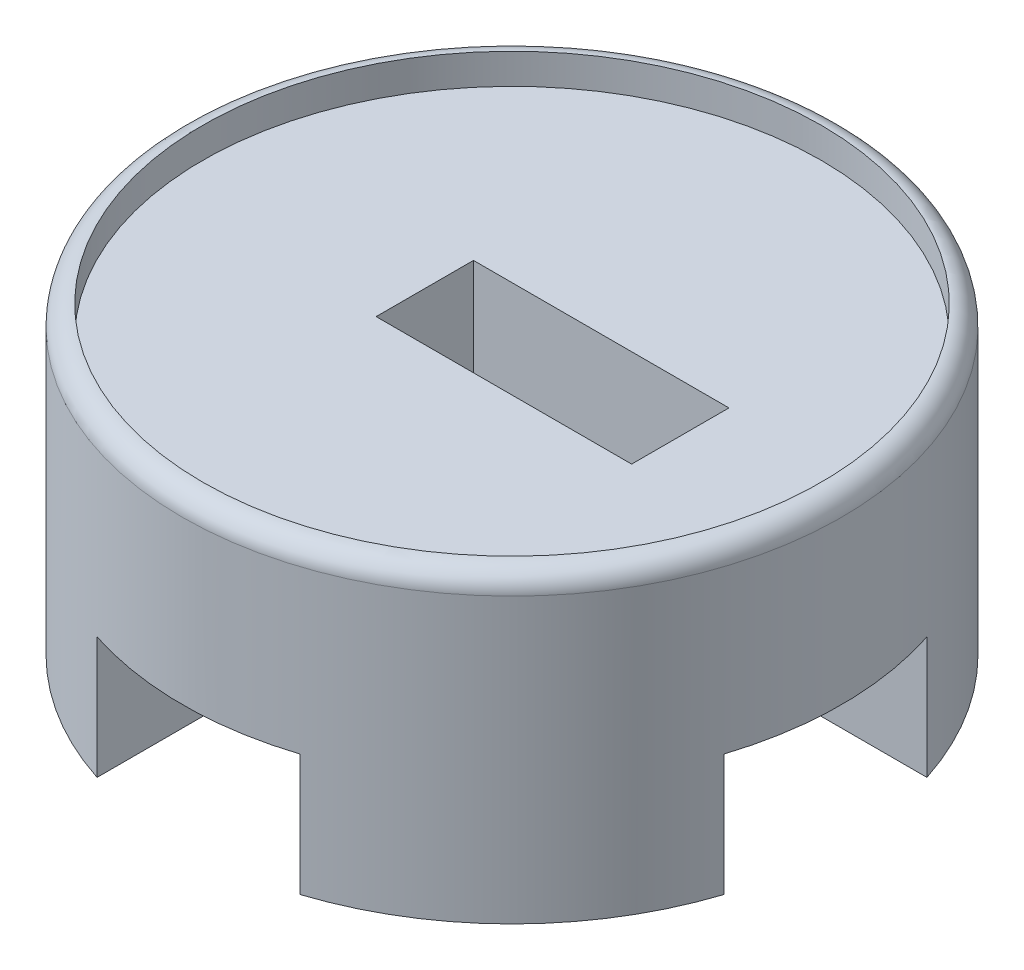
ISO-10303-21;
HEADER;
FILE_DESCRIPTION(('STEP AP214'),'2;1');
FILE_NAME('part.step','',(''),(''),'','','');
FILE_SCHEMA(('AUTOMOTIVE_DESIGN { 1 0 10303 214 1 1 1 1 }'));
ENDSEC;
DATA;
#1=APPLICATION_CONTEXT('core data for automotive mechanical design processes');
#2=APPLICATION_PROTOCOL_DEFINITION('international standard','automotive_design',2000,#1);
#3=PRODUCT_CONTEXT('',#1,'mechanical');
#4=PRODUCT('Part','Part','',(#3));
#5=PRODUCT_RELATED_PRODUCT_CATEGORY('part','',(#4));
#6=PRODUCT_DEFINITION_FORMATION('','',#4);
#7=PRODUCT_DEFINITION_CONTEXT('part definition',#1,'design');
#8=PRODUCT_DEFINITION('design','',#6,#7);
#9=PRODUCT_DEFINITION_SHAPE('','',#8);
#10=(LENGTH_UNIT() NAMED_UNIT(*) SI_UNIT(.MILLI.,.METRE.));
#11=(NAMED_UNIT(*) PLANE_ANGLE_UNIT() SI_UNIT($,.RADIAN.));
#12=(NAMED_UNIT(*) SI_UNIT($,.STERADIAN.) SOLID_ANGLE_UNIT());
#13=UNCERTAINTY_MEASURE_WITH_UNIT(LENGTH_MEASURE(1.E-05),#10,'distance_accuracy_value','');
#14=(GEOMETRIC_REPRESENTATION_CONTEXT(3) GLOBAL_UNCERTAINTY_ASSIGNED_CONTEXT((#13)) GLOBAL_UNIT_ASSIGNED_CONTEXT((#10,
#11,#12)) REPRESENTATION_CONTEXT('',''));
#15=CARTESIAN_POINT('',(0.,0.,0.));
#16=DIRECTION('',(0.,0.,1.));
#17=DIRECTION('',(1.,0.,0.));
#18=AXIS2_PLACEMENT_3D('',#15,#16,#17);
#19=CARTESIAN_POINT('',(0.,20.32,0.));
#20=DIRECTION('',(0.,-1.,0.));
#21=DIRECTION('',(0.,0.,-1.));
#22=AXIS2_PLACEMENT_3D('',#19,#20,#21);
#23=PLANE('',#22);
#24=DIRECTION('',(0.,0.,-1.));
#25=VECTOR('',#24,1.);
#26=CARTESIAN_POINT('',(16.383,20.32,0.));
#27=LINE('',#26,#25);
#28=CARTESIAN_POINT('',(16.383,20.32,6.096));
#29=VERTEX_POINT('',#28);
#30=CARTESIAN_POINT('',(16.383,20.32,-6.096));
#31=VERTEX_POINT('',#30);
#32=EDGE_CURVE('E203',#29,#31,#27,.T.);
#33=ORIENTED_EDGE('',*,*,#32,.F.);
#34=DIRECTION('',(1.,0.,0.));
#35=VECTOR('',#34,1.);
#36=CARTESIAN_POINT('',(-10.922,20.32,6.096));
#37=LINE('',#36,#35);
#38=CARTESIAN_POINT('',(21.082,20.32,6.096));
#39=VERTEX_POINT('',#38);
#40=EDGE_CURVE('E215',#29,#39,#37,.T.);
#41=ORIENTED_EDGE('',*,*,#40,.T.);
#42=DIRECTION('',(0.,0.,-1.));
#43=VECTOR('',#42,1.);
#44=CARTESIAN_POINT('',(21.082,20.32,6.096));
#45=LINE('',#44,#43);
#46=CARTESIAN_POINT('',(21.082,20.32,-6.096));
#47=VERTEX_POINT('',#46);
#48=EDGE_CURVE('E228',#39,#47,#45,.T.);
#49=ORIENTED_EDGE('',*,*,#48,.T.);
#50=DIRECTION('',(-1.,0.,0.));
#51=VECTOR('',#50,1.);
#52=CARTESIAN_POINT('',(-10.922,20.32,-6.096));
#53=LINE('',#52,#51);
#54=EDGE_CURVE('E218',#47,#31,#53,.T.);
#55=ORIENTED_EDGE('',*,*,#54,.T.);
#56=EDGE_LOOP('',(#33,#41,#49,#55));
#57=FACE_BOUND('',#56,.T.);
#58=ADVANCED_FACE('F39',(#57),#23,.F.);
#59=CARTESIAN_POINT('',(0.,38.1,0.));
#60=DIRECTION('',(0.,-1.,0.));
#61=DIRECTION('',(0.,0.,-1.));
#62=AXIS2_PLACEMENT_3D('',#59,#60,#61);
#63=CYLINDRICAL_SURFACE('',#62,41.275);
#64=CARTESIAN_POINT('',(0.,35.56,0.));
#65=DIRECTION('',(0.,1.,0.));
#66=DIRECTION('',(0.,0.,1.));
#67=AXIS2_PLACEMENT_3D('',#64,#65,#66);
#68=CIRCLE('',#67,41.275);
#69=CARTESIAN_POINT('',(0.,35.56,41.275));
#70=VERTEX_POINT('',#69);
#71=EDGE_CURVE('E351',#70,#70,#68,.F.);
#72=ORIENTED_EDGE('',*,*,#71,.T.);
#73=EDGE_LOOP('',(#72));
#74=FACE_BOUND('',#73,.T.);
#75=CARTESIAN_POINT('',(0.,15.24,0.));
#76=DIRECTION('',(0.,1.,0.));
#77=DIRECTION('',(0.,0.,1.));
#78=AXIS2_PLACEMENT_3D('',#75,#76,#77);
#79=CIRCLE('',#78,41.275);
#80=CARTESIAN_POINT('',(39.2725810840082,15.24,-12.7));
#81=VERTEX_POINT('',#80);
#82=CARTESIAN_POINT('',(39.2725810840082,15.24,12.7));
#83=VERTEX_POINT('',#82);
#84=EDGE_CURVE('E309',#81,#83,#79,.F.);
#85=ORIENTED_EDGE('',*,*,#84,.F.);
#86=DIRECTION('',(0.,-1.,0.));
#87=VECTOR('',#86,1.);
#88=CARTESIAN_POINT('',(39.2725810840082,151.033329573899,-12.7));
#89=LINE('',#88,#87);
#90=CARTESIAN_POINT('',(39.2725810840082,0.,-12.7));
#91=VERTEX_POINT('',#90);
#92=EDGE_CURVE('E283',#81,#91,#89,.T.);
#93=ORIENTED_EDGE('',*,*,#92,.T.);
#94=CARTESIAN_POINT('',(0.,0.,0.));
#95=DIRECTION('',(0.,1.,0.));
#96=DIRECTION('',(0.,0.,1.));
#97=AXIS2_PLACEMENT_3D('',#94,#95,#96);
#98=CIRCLE('',#97,41.275);
#99=CARTESIAN_POINT('',(12.7,0.,-39.2725810840082));
#100=VERTEX_POINT('',#99);
#101=EDGE_CURVE('E335',#91,#100,#98,.T.);
#102=ORIENTED_EDGE('',*,*,#101,.T.);
#103=DIRECTION('',(0.,-1.,0.));
#104=VECTOR('',#103,1.);
#105=CARTESIAN_POINT('',(12.7,151.033329573899,-39.2725810840082));
#106=LINE('',#105,#104);
#107=CARTESIAN_POINT('',(12.7,15.24,-39.2725810840082));
#108=VERTEX_POINT('',#107);
#109=EDGE_CURVE('E288',#108,#100,#106,.T.);
#110=ORIENTED_EDGE('',*,*,#109,.F.);
#111=CARTESIAN_POINT('',(0.,15.24,0.));
#112=DIRECTION('',(0.,1.,0.));
#113=DIRECTION('',(0.,0.,1.));
#114=AXIS2_PLACEMENT_3D('',#111,#112,#113);
#115=CIRCLE('',#114,41.275);
#116=CARTESIAN_POINT('',(-12.7,15.24,-39.2725810840082));
#117=VERTEX_POINT('',#116);
#118=EDGE_CURVE('E257',#117,#108,#115,.F.);
#119=ORIENTED_EDGE('',*,*,#118,.F.);
#120=DIRECTION('',(0.,-1.,0.));
#121=VECTOR('',#120,1.);
#122=CARTESIAN_POINT('',(-12.7,151.033329573899,-39.2725810840082));
#123=LINE('',#122,#121);
#124=CARTESIAN_POINT('',(-12.7,0.,-39.2725810840082));
#125=VERTEX_POINT('',#124);
#126=EDGE_CURVE('E258',#117,#125,#123,.T.);
#127=ORIENTED_EDGE('',*,*,#126,.T.);
#128=CARTESIAN_POINT('',(-39.2725810840082,0.,-12.7));
#129=VERTEX_POINT('',#128);
#130=EDGE_CURVE('E400',#125,#129,#98,.T.);
#131=ORIENTED_EDGE('',*,*,#130,.T.);
#132=DIRECTION('',(0.,-1.,0.));
#133=VECTOR('',#132,1.);
#134=CARTESIAN_POINT('',(-39.2725810840082,151.033329573899,-12.7));
#135=LINE('',#134,#133);
#136=CARTESIAN_POINT('',(-39.2725810840082,15.24,-12.7));
#137=VERTEX_POINT('',#136);
#138=EDGE_CURVE('E296',#137,#129,#135,.T.);
#139=ORIENTED_EDGE('',*,*,#138,.F.);
#140=CARTESIAN_POINT('',(0.,15.24,0.));
#141=DIRECTION('',(0.,1.,0.));
#142=DIRECTION('',(0.,0.,1.));
#143=AXIS2_PLACEMENT_3D('',#140,#141,#142);
#144=CIRCLE('',#143,41.275);
#145=CARTESIAN_POINT('',(-39.2725810840082,15.24,12.7));
#146=VERTEX_POINT('',#145);
#147=EDGE_CURVE('E266',#146,#137,#144,.F.);
#148=ORIENTED_EDGE('',*,*,#147,.F.);
#149=DIRECTION('',(0.,-1.,0.));
#150=VECTOR('',#149,1.);
#151=CARTESIAN_POINT('',(-39.2725810840082,151.033329573899,12.7));
#152=LINE('',#151,#150);
#153=CARTESIAN_POINT('',(-39.2725810840082,0.,12.7));
#154=VERTEX_POINT('',#153);
#155=EDGE_CURVE('E267',#146,#154,#152,.T.);
#156=ORIENTED_EDGE('',*,*,#155,.T.);
#157=CARTESIAN_POINT('',(-12.7,0.,39.2725810840082));
#158=VERTEX_POINT('',#157);
#159=EDGE_CURVE('E329',#154,#158,#98,.T.);
#160=ORIENTED_EDGE('',*,*,#159,.T.);
#161=DIRECTION('',(0.,-1.,0.));
#162=VECTOR('',#161,1.);
#163=CARTESIAN_POINT('',(-12.7,151.033329573899,39.2725810840082));
#164=LINE('',#163,#162);
#165=CARTESIAN_POINT('',(-12.7,15.24,39.2725810840082));
#166=VERTEX_POINT('',#165);
#167=EDGE_CURVE('E270',#166,#158,#164,.T.);
#168=ORIENTED_EDGE('',*,*,#167,.F.);
#169=CARTESIAN_POINT('',(0.,15.24,0.));
#170=DIRECTION('',(0.,1.,0.));
#171=DIRECTION('',(0.,0.,1.));
#172=AXIS2_PLACEMENT_3D('',#169,#170,#171);
#173=CIRCLE('',#172,41.275);
#174=CARTESIAN_POINT('',(12.7,15.24,39.2725810840082));
#175=VERTEX_POINT('',#174);
#176=EDGE_CURVE('E303',#175,#166,#173,.F.);
#177=ORIENTED_EDGE('',*,*,#176,.F.);
#178=DIRECTION('',(0.,-1.,0.));
#179=VECTOR('',#178,1.);
#180=CARTESIAN_POINT('',(12.7,151.033329573899,39.2725810840082));
#181=LINE('',#180,#179);
#182=CARTESIAN_POINT('',(12.7,0.,39.2725810840082));
#183=VERTEX_POINT('',#182);
#184=EDGE_CURVE('E306',#175,#183,#181,.T.);
#185=ORIENTED_EDGE('',*,*,#184,.T.);
#186=CARTESIAN_POINT('',(39.2725810840082,0.,12.7));
#187=VERTEX_POINT('',#186);
#188=EDGE_CURVE('E332',#183,#187,#98,.T.);
#189=ORIENTED_EDGE('',*,*,#188,.T.);
#190=DIRECTION('',(0.,-1.,0.));
#191=VECTOR('',#190,1.);
#192=CARTESIAN_POINT('',(39.2725810840082,151.033329573899,12.7));
#193=LINE('',#192,#191);
#194=EDGE_CURVE('E276',#83,#187,#193,.T.);
#195=ORIENTED_EDGE('',*,*,#194,.F.);
#196=EDGE_LOOP('',(#85,#93,#102,#110,#119,#127,#131,#139,#148,#156,#160,#168,#177,#185,#189,#195));
#197=FACE_BOUND('',#196,.T.);
#198=ADVANCED_FACE('F399',(#74,#197),#63,.T.);
#199=CARTESIAN_POINT('',(0.,0.,0.));
#200=DIRECTION('',(0.,1.,0.));
#201=DIRECTION('',(0.,0.,1.));
#202=AXIS2_PLACEMENT_3D('',#199,#200,#201);
#203=PLANE('',#202);
#204=DIRECTION('',(0.,0.,1.));
#205=VECTOR('',#204,1.);
#206=CARTESIAN_POINT('',(12.7,0.,0.));
#207=LINE('',#206,#205);
#208=CARTESIAN_POINT('',(12.7,0.,15.24));
#209=VERTEX_POINT('',#208);
#210=EDGE_CURVE('E262',#209,#183,#207,.T.);
#211=ORIENTED_EDGE('',*,*,#210,.F.);
#212=CARTESIAN_POINT('',(15.24,0.,15.24));
#213=DIRECTION('',(0.,1.,0.));
#214=DIRECTION('',(0.,0.,1.));
#215=AXIS2_PLACEMENT_3D('',#212,#213,#214);
#216=CIRCLE('',#215,2.54);
#217=CARTESIAN_POINT('',(15.24,0.,12.7));
#218=VERTEX_POINT('',#217);
#219=EDGE_CURVE('E357',#209,#218,#216,.F.);
#220=ORIENTED_EDGE('',*,*,#219,.T.);
#221=DIRECTION('',(1.,0.,0.));
#222=VECTOR('',#221,1.);
#223=CARTESIAN_POINT('',(0.,0.,12.7));
#224=LINE('',#223,#222);
#225=EDGE_CURVE('E273',#218,#187,#224,.T.);
#226=ORIENTED_EDGE('',*,*,#225,.T.);
#227=ORIENTED_EDGE('',*,*,#188,.F.);
#228=EDGE_LOOP('',(#211,#220,#226,#227));
#229=FACE_BOUND('',#228,.T.);
#230=ADVANCED_FACE('F438',(#229),#203,.F.);
#231=DIRECTION('',(1.,0.,0.));
#232=VECTOR('',#231,1.);
#233=CARTESIAN_POINT('',(0.,0.,12.7));
#234=LINE('',#233,#232);
#235=CARTESIAN_POINT('',(-15.24,0.,12.7));
#236=VERTEX_POINT('',#235);
#237=EDGE_CURVE('E263',#154,#236,#234,.T.);
#238=ORIENTED_EDGE('',*,*,#237,.T.);
#239=CARTESIAN_POINT('',(-15.24,0.,15.24));
#240=DIRECTION('',(0.,1.,0.));
#241=DIRECTION('',(0.,0.,1.));
#242=AXIS2_PLACEMENT_3D('',#239,#240,#241);
#243=CIRCLE('',#242,2.54);
#244=CARTESIAN_POINT('',(-12.7,0.,15.24));
#245=VERTEX_POINT('',#244);
#246=EDGE_CURVE('E364',#236,#245,#243,.F.);
#247=ORIENTED_EDGE('',*,*,#246,.T.);
#248=DIRECTION('',(0.,0.,1.));
#249=VECTOR('',#248,1.);
#250=CARTESIAN_POINT('',(-12.7,0.,0.));
#251=LINE('',#250,#249);
#252=EDGE_CURVE('E268',#245,#158,#251,.T.);
#253=ORIENTED_EDGE('',*,*,#252,.T.);
#254=ORIENTED_EDGE('',*,*,#159,.F.);
#255=EDGE_LOOP('',(#238,#247,#253,#254));
#256=FACE_BOUND('',#255,.T.);
#257=ADVANCED_FACE('F390',(#256),#203,.F.);
#258=DIRECTION('',(0.,0.,1.));
#259=VECTOR('',#258,1.);
#260=CARTESIAN_POINT('',(-12.7,0.,0.));
#261=LINE('',#260,#259);
#262=CARTESIAN_POINT('',(-12.7,0.,-15.24));
#263=VERTEX_POINT('',#262);
#264=EDGE_CURVE('E255',#125,#263,#261,.T.);
#265=ORIENTED_EDGE('',*,*,#264,.T.);
#266=CARTESIAN_POINT('',(-15.24,0.,-15.24));
#267=DIRECTION('',(0.,1.,0.));
#268=DIRECTION('',(0.,0.,1.));
#269=AXIS2_PLACEMENT_3D('',#266,#267,#268);
#270=CIRCLE('',#269,2.54);
#271=CARTESIAN_POINT('',(-15.24,0.,-12.7));
#272=VERTEX_POINT('',#271);
#273=EDGE_CURVE('E62',#263,#272,#270,.F.);
#274=ORIENTED_EDGE('',*,*,#273,.T.);
#275=DIRECTION('',(1.,0.,0.));
#276=VECTOR('',#275,1.);
#277=CARTESIAN_POINT('',(0.,0.,-12.7));
#278=LINE('',#277,#276);
#279=EDGE_CURVE('E259',#129,#272,#278,.T.);
#280=ORIENTED_EDGE('',*,*,#279,.F.);
#281=ORIENTED_EDGE('',*,*,#130,.F.);
#282=EDGE_LOOP('',(#265,#274,#280,#281));
#283=FACE_BOUND('',#282,.T.);
#284=ADVANCED_FACE('F501',(#283),#203,.F.);
#285=DIRECTION('',(1.,0.,0.));
#286=VECTOR('',#285,1.);
#287=CARTESIAN_POINT('',(0.,0.,-12.7));
#288=LINE('',#287,#286);
#289=CARTESIAN_POINT('',(15.24,0.,-12.7));
#290=VERTEX_POINT('',#289);
#291=EDGE_CURVE('E272',#290,#91,#288,.T.);
#292=ORIENTED_EDGE('',*,*,#291,.F.);
#293=CARTESIAN_POINT('',(15.24,0.,-15.24));
#294=DIRECTION('',(0.,1.,0.));
#295=DIRECTION('',(0.,0.,1.));
#296=AXIS2_PLACEMENT_3D('',#293,#294,#295);
#297=CIRCLE('',#296,2.54);
#298=CARTESIAN_POINT('',(12.7,0.,-15.24));
#299=VERTEX_POINT('',#298);
#300=EDGE_CURVE('E347',#290,#299,#297,.F.);
#301=ORIENTED_EDGE('',*,*,#300,.T.);
#302=DIRECTION('',(0.,0.,1.));
#303=VECTOR('',#302,1.);
#304=CARTESIAN_POINT('',(12.7,0.,0.));
#305=LINE('',#304,#303);
#306=EDGE_CURVE('E278',#100,#299,#305,.T.);
#307=ORIENTED_EDGE('',*,*,#306,.F.);
#308=ORIENTED_EDGE('',*,*,#101,.F.);
#309=EDGE_LOOP('',(#292,#301,#307,#308));
#310=FACE_BOUND('',#309,.T.);
#311=ADVANCED_FACE('F412',(#310),#203,.F.);
#312=CARTESIAN_POINT('',(0.,34.29,0.));
#313=DIRECTION('',(0.,1.,0.));
#314=DIRECTION('',(0.,0.,1.));
#315=AXIS2_PLACEMENT_3D('',#312,#313,#314);
#316=CYLINDRICAL_SURFACE('',#315,38.735);
#317=CARTESIAN_POINT('',(0.,34.29,0.));
#318=DIRECTION('',(0.,1.,0.));
#319=DIRECTION('',(0.,0.,1.));
#320=AXIS2_PLACEMENT_3D('',#317,#318,#319);
#321=CIRCLE('',#320,38.735);
#322=CARTESIAN_POINT('',(0.,34.29,38.735));
#323=VERTEX_POINT('',#322);
#324=EDGE_CURVE('E326',#323,#323,#321,.T.);
#325=CARTESIAN_POINT('',(0.,38.1,0.));
#326=DIRECTION('',(0.,1.,0.));
#327=DIRECTION('',(0.,0.,1.));
#328=AXIS2_PLACEMENT_3D('',#325,#326,#327);
#329=CIRCLE('',#328,38.735);
#330=CARTESIAN_POINT('',(0.,38.1,38.735));
#331=VERTEX_POINT('',#330);
#332=EDGE_CURVE('E287',#331,#331,#329,.T.);
#333=CARTESIAN_POINT('',(0.,34.29,38.735));
#334=CARTESIAN_POINT('',(0.,34.3296875,38.735));
#335=CARTESIAN_POINT('',(0.,34.369375,38.735));
#336=CARTESIAN_POINT('',(0.,34.44875,38.735));
#337=CARTESIAN_POINT('',(0.,34.4884375,38.735));
#338=CARTESIAN_POINT('',(0.,34.5678125,38.735));
#339=CARTESIAN_POINT('',(0.,34.6075,38.735));
#340=CARTESIAN_POINT('',(0.,34.686875,38.735));
#341=CARTESIAN_POINT('',(0.,34.7265625,38.735));
#342=CARTESIAN_POINT('',(0.,34.8059375,38.735));
#343=CARTESIAN_POINT('',(0.,34.845625,38.735));
#344=CARTESIAN_POINT('',(0.,34.925,38.735));
#345=CARTESIAN_POINT('',(0.,34.9646875,38.735));
#346=CARTESIAN_POINT('',(0.,35.0440625,38.735));
#347=CARTESIAN_POINT('',(0.,35.08375,38.735));
#348=CARTESIAN_POINT('',(0.,35.163125,38.735));
#349=CARTESIAN_POINT('',(0.,35.2028125,38.735));
#350=CARTESIAN_POINT('',(0.,35.2821875,38.735));
#351=CARTESIAN_POINT('',(0.,35.321875,38.735));
#352=CARTESIAN_POINT('',(0.,35.40125,38.735));
#353=CARTESIAN_POINT('',(0.,35.4409375,38.735));
#354=CARTESIAN_POINT('',(0.,35.5203125,38.735));
#355=CARTESIAN_POINT('',(0.,35.56,38.735));
#356=CARTESIAN_POINT('',(0.,35.639375,38.735));
#357=CARTESIAN_POINT('',(0.,35.6790625,38.735));
#358=CARTESIAN_POINT('',(0.,35.7584375,38.735));
#359=CARTESIAN_POINT('',(0.,35.798125,38.735));
#360=CARTESIAN_POINT('',(0.,35.8775,38.735));
#361=CARTESIAN_POINT('',(0.,35.9171875,38.735));
#362=CARTESIAN_POINT('',(0.,35.9965625,38.735));
#363=CARTESIAN_POINT('',(0.,36.03625,38.735));
#364=CARTESIAN_POINT('',(0.,36.115625,38.735));
#365=CARTESIAN_POINT('',(0.,36.1553125,38.735));
#366=CARTESIAN_POINT('',(0.,36.2346875,38.735));
#367=CARTESIAN_POINT('',(0.,36.274375,38.735));
#368=CARTESIAN_POINT('',(0.,36.35375,38.735));
#369=CARTESIAN_POINT('',(0.,36.3934375,38.735));
#370=CARTESIAN_POINT('',(0.,36.4728125,38.735));
#371=CARTESIAN_POINT('',(0.,36.5125,38.735));
#372=CARTESIAN_POINT('',(0.,36.591875,38.735));
#373=CARTESIAN_POINT('',(0.,36.6315625,38.735));
#374=CARTESIAN_POINT('',(0.,36.7109375,38.735));
#375=CARTESIAN_POINT('',(0.,36.750625,38.735));
#376=CARTESIAN_POINT('',(0.,36.83,38.735));
#377=CARTESIAN_POINT('',(0.,36.8696875,38.735));
#378=CARTESIAN_POINT('',(0.,36.9490625,38.735));
#379=CARTESIAN_POINT('',(0.,36.98875,38.735));
#380=CARTESIAN_POINT('',(0.,37.068125,38.735));
#381=CARTESIAN_POINT('',(0.,37.1078125,38.735));
#382=CARTESIAN_POINT('',(0.,37.1871875,38.735));
#383=CARTESIAN_POINT('',(0.,37.226875,38.735));
#384=CARTESIAN_POINT('',(0.,37.30625,38.735));
#385=CARTESIAN_POINT('',(0.,37.3459375,38.735));
#386=CARTESIAN_POINT('',(0.,37.4253125,38.735));
#387=CARTESIAN_POINT('',(0.,37.465,38.735));
#388=CARTESIAN_POINT('',(0.,37.544375,38.735));
#389=CARTESIAN_POINT('',(0.,37.5840625,38.735));
#390=CARTESIAN_POINT('',(0.,37.6634375,38.735));
#391=CARTESIAN_POINT('',(0.,37.703125,38.735));
#392=CARTESIAN_POINT('',(0.,37.7825,38.735));
#393=CARTESIAN_POINT('',(0.,37.8221875,38.735));
#394=CARTESIAN_POINT('',(0.,37.9015625,38.735));
#395=CARTESIAN_POINT('',(0.,37.94125,38.735));
#396=CARTESIAN_POINT('',(0.,38.020625,38.735));
#397=CARTESIAN_POINT('',(0.,38.0603125,38.735));
#398=CARTESIAN_POINT('',(0.,38.1,38.735));
#399=B_SPLINE_CURVE_WITH_KNOTS('',3,(#333,#334,#335,#336,#337,#338,#339,#340,#341,#342,#343,
#344,#345,#346,#347,#348,#349,#350,#351,#352,#353,#354,#355,#356,#357,#358,#359,#360,#361,#362,
#363,#364,#365,#366,#367,#368,#369,#370,#371,#372,#373,#374,#375,#376,#377,#378,#379,#380,#381,
#382,#383,#384,#385,#386,#387,#388,#389,#390,#391,#392,#393,#394,#395,#396,#397,#398),
.UNSPECIFIED.,.F.,.F.,(4,2,2,2,2,2,2,2,2,2,2,2,2,2,2,2,2,2,2,2,2,2,2,2,2,2,2,2,2,2,2,2,4),(0.,
0.119062499999996,0.238124999999999,0.357187499999995,0.476249999999998,0.595312499999993,
0.714374999999996,0.833437499999999,0.952499999999995,1.0715625,1.19062499999999,1.3096875,
1.42875,1.5478125,1.666875,1.78593749999999,1.905,2.0240625,2.143125,2.2621875,2.38124999999999,
2.5003125,2.619375,2.7384375,2.8575,2.97656249999999,3.095625,3.2146875,3.33375,3.4528125,
3.571875,3.6909375,3.81),.UNSPECIFIED.);
#400=EDGE_CURVE('BSEAM493',#323,#331,#399,.T.);
#401=ORIENTED_EDGE('',*,*,#324,.F.);
#402=ORIENTED_EDGE('',*,*,#332,.T.);
#403=ORIENTED_EDGE('',*,*,#400,.T.);
#404=ORIENTED_EDGE('',*,*,#400,.F.);
#405=EDGE_LOOP('',(#401,#403,#402,#404));
#406=FACE_BOUND('',#405,.T.);
#407=ADVANCED_FACE('F493',(#406),#316,.F.);
#408=CARTESIAN_POINT('',(0.,34.29,0.));
#409=DIRECTION('',(0.,1.,0.));
#410=DIRECTION('',(0.,0.,1.));
#411=AXIS2_PLACEMENT_3D('',#408,#409,#410);
#412=PLANE('',#411);
#413=DIRECTION('',(0.,0.,1.));
#414=VECTOR('',#413,1.);
#415=CARTESIAN_POINT('',(-10.922,34.29,6.096));
#416=LINE('',#415,#414);
#417=CARTESIAN_POINT('',(-10.922,34.29,-6.096));
#418=VERTEX_POINT('',#417);
#419=CARTESIAN_POINT('',(-10.922,34.29,6.096));
#420=VERTEX_POINT('',#419);
#421=EDGE_CURVE('E237',#418,#420,#416,.T.);
#422=ORIENTED_EDGE('',*,*,#421,.F.);
#423=DIRECTION('',(-1.,0.,0.));
#424=VECTOR('',#423,1.);
#425=CARTESIAN_POINT('',(-10.922,34.29,-6.096));
#426=LINE('',#425,#424);
#427=CARTESIAN_POINT('',(21.082,34.29,-6.096));
#428=VERTEX_POINT('',#427);
#429=EDGE_CURVE('E230',#428,#418,#426,.T.);
#430=ORIENTED_EDGE('',*,*,#429,.F.);
#431=DIRECTION('',(0.,0.,-1.));
#432=VECTOR('',#431,1.);
#433=CARTESIAN_POINT('',(21.082,34.29,6.096));
#434=LINE('',#433,#432);
#435=CARTESIAN_POINT('',(21.082,34.29,6.096));
#436=VERTEX_POINT('',#435);
#437=EDGE_CURVE('E243',#436,#428,#434,.T.);
#438=ORIENTED_EDGE('',*,*,#437,.F.);
#439=DIRECTION('',(1.,0.,0.));
#440=VECTOR('',#439,1.);
#441=CARTESIAN_POINT('',(-10.922,34.29,6.096));
#442=LINE('',#441,#440);
#443=EDGE_CURVE('E240',#420,#436,#442,.T.);
#444=ORIENTED_EDGE('',*,*,#443,.F.);
#445=EDGE_LOOP('',(#422,#430,#438,#444));
#446=FACE_BOUND('',#445,.T.);
#447=ORIENTED_EDGE('',*,*,#324,.T.);
#448=EDGE_LOOP('',(#447));
#449=FACE_BOUND('',#448,.T.);
#450=ADVANCED_FACE('F488',(#446,#449),#412,.T.);
#451=CARTESIAN_POINT('',(0.,15.24,0.));
#452=DIRECTION('',(0.,1.,0.));
#453=DIRECTION('',(0.,0.,1.));
#454=AXIS2_PLACEMENT_3D('',#451,#452,#453);
#455=PLANE('',#454);
#456=DIRECTION('',(0.,0.,-1.));
#457=VECTOR('',#456,1.);
#458=CARTESIAN_POINT('',(-6.223,15.24,0.));
#459=LINE('',#458,#457);
#460=CARTESIAN_POINT('',(-6.223,15.24,6.096));
#461=VERTEX_POINT('',#460);
#462=CARTESIAN_POINT('',(-6.223,15.24,-6.096));
#463=VERTEX_POINT('',#462);
#464=EDGE_CURVE('E340',#461,#463,#459,.T.);
#465=ORIENTED_EDGE('',*,*,#464,.F.);
#466=DIRECTION('',(1.,0.,0.));
#467=VECTOR('',#466,1.);
#468=CARTESIAN_POINT('',(0.,15.24,6.096));
#469=LINE('',#468,#467);
#470=CARTESIAN_POINT('',(16.383,15.24,6.096));
#471=VERTEX_POINT('',#470);
#472=EDGE_CURVE('E342',#461,#471,#469,.T.);
#473=ORIENTED_EDGE('',*,*,#472,.T.);
#474=DIRECTION('',(0.,0.,-1.));
#475=VECTOR('',#474,1.);
#476=CARTESIAN_POINT('',(16.383,15.24,0.));
#477=LINE('',#476,#475);
#478=CARTESIAN_POINT('',(16.383,15.24,-6.096));
#479=VERTEX_POINT('',#478);
#480=EDGE_CURVE('E206',#471,#479,#477,.T.);
#481=ORIENTED_EDGE('',*,*,#480,.T.);
#482=DIRECTION('',(-1.,0.,0.));
#483=VECTOR('',#482,1.);
#484=CARTESIAN_POINT('',(0.,15.24,-6.096));
#485=LINE('',#484,#483);
#486=EDGE_CURVE('E337',#479,#463,#485,.T.);
#487=ORIENTED_EDGE('',*,*,#486,.T.);
#488=EDGE_LOOP('',(#465,#473,#481,#487));
#489=FACE_BOUND('',#488,.T.);
#490=DIRECTION('',(0.,0.,1.));
#491=VECTOR('',#490,1.);
#492=CARTESIAN_POINT('',(12.7,15.24,0.));
#493=LINE('',#492,#491);
#494=CARTESIAN_POINT('',(12.7,15.24,-15.24));
#495=VERTEX_POINT('',#494);
#496=EDGE_CURVE('E284',#108,#495,#493,.T.);
#497=ORIENTED_EDGE('',*,*,#496,.T.);
#498=CARTESIAN_POINT('',(15.24,15.24,-15.24));
#499=DIRECTION('',(0.,1.,0.));
#500=DIRECTION('',(0.,0.,1.));
#501=AXIS2_PLACEMENT_3D('',#498,#499,#500);
#502=CIRCLE('',#501,2.54);
#503=CARTESIAN_POINT('',(15.24,15.24,-12.7));
#504=VERTEX_POINT('',#503);
#505=EDGE_CURVE('E373',#495,#504,#502,.T.);
#506=ORIENTED_EDGE('',*,*,#505,.T.);
#507=DIRECTION('',(1.,0.,0.));
#508=VECTOR('',#507,1.);
#509=CARTESIAN_POINT('',(0.,15.24,-12.7));
#510=LINE('',#509,#508);
#511=EDGE_CURVE('E261',#504,#81,#510,.T.);
#512=ORIENTED_EDGE('',*,*,#511,.T.);
#513=ORIENTED_EDGE('',*,*,#84,.T.);
#514=DIRECTION('',(1.,0.,0.));
#515=VECTOR('',#514,1.);
#516=CARTESIAN_POINT('',(0.,15.24,12.7));
#517=LINE('',#516,#515);
#518=CARTESIAN_POINT('',(15.24,15.24,12.7));
#519=VERTEX_POINT('',#518);
#520=EDGE_CURVE('E281',#519,#83,#517,.T.);
#521=ORIENTED_EDGE('',*,*,#520,.F.);
#522=CARTESIAN_POINT('',(15.24,15.24,15.24));
#523=DIRECTION('',(0.,1.,0.));
#524=DIRECTION('',(0.,0.,1.));
#525=AXIS2_PLACEMENT_3D('',#522,#523,#524);
#526=CIRCLE('',#525,2.54);
#527=CARTESIAN_POINT('',(12.7,15.24,15.24));
#528=VERTEX_POINT('',#527);
#529=EDGE_CURVE('E375',#519,#528,#526,.T.);
#530=ORIENTED_EDGE('',*,*,#529,.T.);
#531=DIRECTION('',(0.,0.,1.));
#532=VECTOR('',#531,1.);
#533=CARTESIAN_POINT('',(12.7,15.24,0.));
#534=LINE('',#533,#532);
#535=EDGE_CURVE('E275',#528,#175,#534,.T.);
#536=ORIENTED_EDGE('',*,*,#535,.T.);
#537=ORIENTED_EDGE('',*,*,#176,.T.);
#538=DIRECTION('',(0.,0.,1.));
#539=VECTOR('',#538,1.);
#540=CARTESIAN_POINT('',(-12.7,15.24,0.));
#541=LINE('',#540,#539);
#542=CARTESIAN_POINT('',(-12.7,15.24,15.24));
#543=VERTEX_POINT('',#542);
#544=EDGE_CURVE('E301',#543,#166,#541,.T.);
#545=ORIENTED_EDGE('',*,*,#544,.F.);
#546=CARTESIAN_POINT('',(-15.24,15.24,15.24));
#547=DIRECTION('',(0.,1.,0.));
#548=DIRECTION('',(0.,0.,1.));
#549=AXIS2_PLACEMENT_3D('',#546,#547,#548);
#550=CIRCLE('',#549,2.54);
#551=CARTESIAN_POINT('',(-15.24,15.24,12.7));
#552=VERTEX_POINT('',#551);
#553=EDGE_CURVE('E47',#543,#552,#550,.T.);
#554=ORIENTED_EDGE('',*,*,#553,.T.);
#555=DIRECTION('',(1.,0.,0.));
#556=VECTOR('',#555,1.);
#557=CARTESIAN_POINT('',(0.,15.24,12.7));
#558=LINE('',#557,#556);
#559=EDGE_CURVE('E293',#146,#552,#558,.T.);
#560=ORIENTED_EDGE('',*,*,#559,.F.);
#561=ORIENTED_EDGE('',*,*,#147,.T.);
#562=DIRECTION('',(1.,0.,0.));
#563=VECTOR('',#562,1.);
#564=CARTESIAN_POINT('',(0.,15.24,-12.7));
#565=LINE('',#564,#563);
#566=CARTESIAN_POINT('',(-15.24,15.24,-12.7));
#567=VERTEX_POINT('',#566);
#568=EDGE_CURVE('E294',#137,#567,#565,.T.);
#569=ORIENTED_EDGE('',*,*,#568,.T.);
#570=CARTESIAN_POINT('',(-15.24,15.24,-15.24));
#571=DIRECTION('',(0.,1.,0.));
#572=DIRECTION('',(0.,0.,1.));
#573=AXIS2_PLACEMENT_3D('',#570,#571,#572);
#574=CIRCLE('',#573,2.54);
#575=CARTESIAN_POINT('',(-12.7,15.24,-15.24));
#576=VERTEX_POINT('',#575);
#577=EDGE_CURVE('E12',#567,#576,#574,.T.);
#578=ORIENTED_EDGE('',*,*,#577,.T.);
#579=DIRECTION('',(0.,0.,1.));
#580=VECTOR('',#579,1.);
#581=CARTESIAN_POINT('',(-12.7,15.24,0.));
#582=LINE('',#581,#580);
#583=EDGE_CURVE('E249',#117,#576,#582,.T.);
#584=ORIENTED_EDGE('',*,*,#583,.F.);
#585=ORIENTED_EDGE('',*,*,#118,.T.);
#586=EDGE_LOOP('',(#497,#506,#512,#513,#521,#530,#536,#537,#545,#554,#560,#561,#569,#578,#584,#585));
#587=FACE_BOUND('',#586,.T.);
#588=ADVANCED_FACE('F380',(#489,#587),#455,.F.);
#589=CARTESIAN_POINT('',(0.,151.033329573899,-12.7));
#590=DIRECTION('',(0.,0.,-1.));
#591=DIRECTION('',(-1.,0.,0.));
#592=AXIS2_PLACEMENT_3D('',#589,#590,#591);
#593=PLANE('',#592);
#594=ORIENTED_EDGE('',*,*,#511,.F.);
#595=DIRECTION('',(0.,-1.,0.));
#596=VECTOR('',#595,1.);
#597=CARTESIAN_POINT('',(15.24,151.033329573899,-12.7));
#598=LINE('',#597,#596);
#599=EDGE_CURVE('E344',#504,#290,#598,.T.);
#600=ORIENTED_EDGE('',*,*,#599,.T.);
#601=ORIENTED_EDGE('',*,*,#291,.T.);
#602=ORIENTED_EDGE('',*,*,#92,.F.);
#603=EDGE_LOOP('',(#594,#600,#601,#602));
#604=FACE_BOUND('',#603,.T.);
#605=ADVANCED_FACE('F422',(#604),#593,.F.);
#606=CARTESIAN_POINT('',(0.,151.033329573899,12.7));
#607=DIRECTION('',(0.,0.,-1.));
#608=DIRECTION('',(-1.,0.,0.));
#609=AXIS2_PLACEMENT_3D('',#606,#607,#608);
#610=PLANE('',#609);
#611=ORIENTED_EDGE('',*,*,#225,.F.);
#612=DIRECTION('',(0.,-1.,0.));
#613=VECTOR('',#612,1.);
#614=CARTESIAN_POINT('',(15.24,15.24,12.7));
#615=LINE('',#614,#613);
#616=EDGE_CURVE('E359',#218,#519,#615,.F.);
#617=ORIENTED_EDGE('',*,*,#616,.T.);
#618=ORIENTED_EDGE('',*,*,#520,.T.);
#619=ORIENTED_EDGE('',*,*,#194,.T.);
#620=EDGE_LOOP('',(#611,#617,#618,#619));
#621=FACE_BOUND('',#620,.T.);
#622=ADVANCED_FACE('F440',(#621),#610,.T.);
#623=CARTESIAN_POINT('',(12.7,151.033329573899,0.));
#624=DIRECTION('',(1.,0.,0.));
#625=DIRECTION('',(0.,0.,-1.));
#626=AXIS2_PLACEMENT_3D('',#623,#624,#625);
#627=PLANE('',#626);
#628=ORIENTED_EDGE('',*,*,#535,.F.);
#629=DIRECTION('',(0.,-1.,0.));
#630=VECTOR('',#629,1.);
#631=CARTESIAN_POINT('',(12.7,0.,15.24));
#632=LINE('',#631,#630);
#633=EDGE_CURVE('E354',#528,#209,#632,.T.);
#634=ORIENTED_EDGE('',*,*,#633,.T.);
#635=ORIENTED_EDGE('',*,*,#210,.T.);
#636=ORIENTED_EDGE('',*,*,#184,.F.);
#637=EDGE_LOOP('',(#628,#634,#635,#636));
#638=FACE_BOUND('',#637,.T.);
#639=ADVANCED_FACE('F434',(#638),#627,.F.);
#640=CARTESIAN_POINT('',(-12.7,151.033329573899,0.));
#641=DIRECTION('',(1.,0.,0.));
#642=DIRECTION('',(0.,0.,-1.));
#643=AXIS2_PLACEMENT_3D('',#640,#641,#642);
#644=PLANE('',#643);
#645=ORIENTED_EDGE('',*,*,#252,.F.);
#646=DIRECTION('',(0.,-1.,0.));
#647=VECTOR('',#646,1.);
#648=CARTESIAN_POINT('',(-12.7,151.033329573899,15.24));
#649=LINE('',#648,#647);
#650=EDGE_CURVE('E366',#245,#543,#649,.F.);
#651=ORIENTED_EDGE('',*,*,#650,.T.);
#652=ORIENTED_EDGE('',*,*,#544,.T.);
#653=ORIENTED_EDGE('',*,*,#167,.T.);
#654=EDGE_LOOP('',(#645,#651,#652,#653));
#655=FACE_BOUND('',#654,.T.);
#656=ADVANCED_FACE('F393',(#655),#644,.T.);
#657=CARTESIAN_POINT('',(0.,151.033329573899,12.7));
#658=DIRECTION('',(0.,0.,-1.));
#659=DIRECTION('',(-1.,0.,0.));
#660=AXIS2_PLACEMENT_3D('',#657,#658,#659);
#661=PLANE('',#660);
#662=ORIENTED_EDGE('',*,*,#559,.T.);
#663=DIRECTION('',(0.,-1.,0.));
#664=VECTOR('',#663,1.);
#665=CARTESIAN_POINT('',(-15.24,151.033329573899,12.7));
#666=LINE('',#665,#664);
#667=EDGE_CURVE('E361',#552,#236,#666,.T.);
#668=ORIENTED_EDGE('',*,*,#667,.T.);
#669=ORIENTED_EDGE('',*,*,#237,.F.);
#670=ORIENTED_EDGE('',*,*,#155,.F.);
#671=EDGE_LOOP('',(#662,#668,#669,#670));
#672=FACE_BOUND('',#671,.T.);
#673=ADVANCED_FACE('F386',(#672),#661,.T.);
#674=CARTESIAN_POINT('',(0.,151.033329573899,-12.7));
#675=DIRECTION('',(0.,0.,-1.));
#676=DIRECTION('',(-1.,0.,0.));
#677=AXIS2_PLACEMENT_3D('',#674,#675,#676);
#678=PLANE('',#677);
#679=ORIENTED_EDGE('',*,*,#279,.T.);
#680=DIRECTION('',(0.,-1.,0.));
#681=VECTOR('',#680,1.);
#682=CARTESIAN_POINT('',(-15.24,15.24,-12.7));
#683=LINE('',#682,#681);
#684=EDGE_CURVE('E54',#272,#567,#683,.F.);
#685=ORIENTED_EDGE('',*,*,#684,.T.);
#686=ORIENTED_EDGE('',*,*,#568,.F.);
#687=ORIENTED_EDGE('',*,*,#138,.T.);
#688=EDGE_LOOP('',(#679,#685,#686,#687));
#689=FACE_BOUND('',#688,.T.);
#690=ADVANCED_FACE('F522',(#689),#678,.F.);
#691=CARTESIAN_POINT('',(-12.7,151.033329573899,0.));
#692=DIRECTION('',(1.,0.,0.));
#693=DIRECTION('',(0.,0.,-1.));
#694=AXIS2_PLACEMENT_3D('',#691,#692,#693);
#695=PLANE('',#694);
#696=ORIENTED_EDGE('',*,*,#583,.T.);
#697=DIRECTION('',(0.,-1.,0.));
#698=VECTOR('',#697,1.);
#699=CARTESIAN_POINT('',(-12.7,0.,-15.24));
#700=LINE('',#699,#698);
#701=EDGE_CURVE('E368',#576,#263,#700,.T.);
#702=ORIENTED_EDGE('',*,*,#701,.T.);
#703=ORIENTED_EDGE('',*,*,#264,.F.);
#704=ORIENTED_EDGE('',*,*,#126,.F.);
#705=EDGE_LOOP('',(#696,#702,#703,#704));
#706=FACE_BOUND('',#705,.T.);
#707=ADVANCED_FACE('F521',(#706),#695,.T.);
#708=CARTESIAN_POINT('',(12.7,151.033329573899,0.));
#709=DIRECTION('',(1.,0.,0.));
#710=DIRECTION('',(0.,0.,-1.));
#711=AXIS2_PLACEMENT_3D('',#708,#709,#710);
#712=PLANE('',#711);
#713=ORIENTED_EDGE('',*,*,#306,.T.);
#714=DIRECTION('',(0.,-1.,0.));
#715=VECTOR('',#714,1.);
#716=CARTESIAN_POINT('',(12.7,151.033329573899,-15.24));
#717=LINE('',#716,#715);
#718=EDGE_CURVE('E349',#299,#495,#717,.F.);
#719=ORIENTED_EDGE('',*,*,#718,.T.);
#720=ORIENTED_EDGE('',*,*,#496,.F.);
#721=ORIENTED_EDGE('',*,*,#109,.T.);
#722=EDGE_LOOP('',(#713,#719,#720,#721));
#723=FACE_BOUND('',#722,.T.);
#724=ADVANCED_FACE('F415',(#723),#712,.F.);
#725=CARTESIAN_POINT('',(-10.922,20.32,6.096));
#726=DIRECTION('',(-1.,0.,0.));
#727=DIRECTION('',(0.,0.,1.));
#728=AXIS2_PLACEMENT_3D('',#725,#726,#727);
#729=PLANE('',#728);
#730=ORIENTED_EDGE('',*,*,#421,.T.);
#731=DIRECTION('',(0.,1.,0.));
#732=VECTOR('',#731,1.);
#733=CARTESIAN_POINT('',(-10.922,20.32,6.096));
#734=LINE('',#733,#732);
#735=CARTESIAN_POINT('',(-10.922,20.32,6.096));
#736=VERTEX_POINT('',#735);
#737=EDGE_CURVE('E236',#736,#420,#734,.T.);
#738=ORIENTED_EDGE('',*,*,#737,.F.);
#739=DIRECTION('',(0.,0.,1.));
#740=VECTOR('',#739,1.);
#741=CARTESIAN_POINT('',(-10.922,20.32,6.096));
#742=LINE('',#741,#740);
#743=CARTESIAN_POINT('',(-10.922,20.32,-6.096));
#744=VERTEX_POINT('',#743);
#745=EDGE_CURVE('E225',#744,#736,#742,.T.);
#746=ORIENTED_EDGE('',*,*,#745,.F.);
#747=DIRECTION('',(0.,1.,0.));
#748=VECTOR('',#747,1.);
#749=CARTESIAN_POINT('',(-10.922,20.32,-6.096));
#750=LINE('',#749,#748);
#751=EDGE_CURVE('E247',#744,#418,#750,.T.);
#752=ORIENTED_EDGE('',*,*,#751,.T.);
#753=EDGE_LOOP('',(#730,#738,#746,#752));
#754=FACE_BOUND('',#753,.T.);
#755=ADVANCED_FACE('F561',(#754),#729,.F.);
#756=CARTESIAN_POINT('',(-10.922,20.32,-6.096));
#757=DIRECTION('',(0.,0.,-1.));
#758=DIRECTION('',(-1.,0.,0.));
#759=AXIS2_PLACEMENT_3D('',#756,#757,#758);
#760=PLANE('',#759);
#761=ORIENTED_EDGE('',*,*,#429,.T.);
#762=ORIENTED_EDGE('',*,*,#751,.F.);
#763=CARTESIAN_POINT('',(-6.223,20.32,-6.096));
#764=VERTEX_POINT('',#763);
#765=EDGE_CURVE('E234',#764,#744,#53,.T.);
#766=ORIENTED_EDGE('',*,*,#765,.F.);
#767=DIRECTION('',(0.,1.,0.));
#768=VECTOR('',#767,1.);
#769=CARTESIAN_POINT('',(-6.223,0.,-6.096));
#770=LINE('',#769,#768);
#771=EDGE_CURVE('E477',#463,#764,#770,.T.);
#772=ORIENTED_EDGE('',*,*,#771,.F.);
#773=ORIENTED_EDGE('',*,*,#486,.F.);
#774=DIRECTION('',(0.,1.,0.));
#775=VECTOR('',#774,1.);
#776=CARTESIAN_POINT('',(16.383,0.,-6.096));
#777=LINE('',#776,#775);
#778=EDGE_CURVE('E210',#479,#31,#777,.T.);
#779=ORIENTED_EDGE('',*,*,#778,.T.);
#780=ORIENTED_EDGE('',*,*,#54,.F.);
#781=DIRECTION('',(0.,1.,0.));
#782=VECTOR('',#781,1.);
#783=CARTESIAN_POINT('',(21.082,20.32,-6.096));
#784=LINE('',#783,#782);
#785=EDGE_CURVE('E250',#47,#428,#784,.T.);
#786=ORIENTED_EDGE('',*,*,#785,.T.);
#787=EDGE_LOOP('',(#761,#762,#766,#772,#773,#779,#780,#786));
#788=FACE_BOUND('',#787,.T.);
#789=ADVANCED_FACE('F485',(#788),#760,.F.);
#790=CARTESIAN_POINT('',(21.082,20.32,6.096));
#791=DIRECTION('',(1.,0.,0.));
#792=DIRECTION('',(0.,0.,-1.));
#793=AXIS2_PLACEMENT_3D('',#790,#791,#792);
#794=PLANE('',#793);
#795=ORIENTED_EDGE('',*,*,#437,.T.);
#796=ORIENTED_EDGE('',*,*,#785,.F.);
#797=ORIENTED_EDGE('',*,*,#48,.F.);
#798=DIRECTION('',(0.,1.,0.));
#799=VECTOR('',#798,1.);
#800=CARTESIAN_POINT('',(21.082,20.32,6.096));
#801=LINE('',#800,#799);
#802=EDGE_CURVE('E222',#39,#436,#801,.T.);
#803=ORIENTED_EDGE('',*,*,#802,.T.);
#804=EDGE_LOOP('',(#795,#796,#797,#803));
#805=FACE_BOUND('',#804,.T.);
#806=ADVANCED_FACE('F468',(#805),#794,.F.);
#807=CARTESIAN_POINT('',(-10.922,20.32,6.096));
#808=DIRECTION('',(0.,0.,1.));
#809=DIRECTION('',(1.,0.,0.));
#810=AXIS2_PLACEMENT_3D('',#807,#808,#809);
#811=PLANE('',#810);
#812=ORIENTED_EDGE('',*,*,#443,.T.);
#813=ORIENTED_EDGE('',*,*,#802,.F.);
#814=ORIENTED_EDGE('',*,*,#40,.F.);
#815=DIRECTION('',(0.,1.,0.));
#816=VECTOR('',#815,1.);
#817=CARTESIAN_POINT('',(16.383,0.,6.096));
#818=LINE('',#817,#816);
#819=EDGE_CURVE('E200',#471,#29,#818,.T.);
#820=ORIENTED_EDGE('',*,*,#819,.F.);
#821=ORIENTED_EDGE('',*,*,#472,.F.);
#822=DIRECTION('',(0.,1.,0.));
#823=VECTOR('',#822,1.);
#824=CARTESIAN_POINT('',(-6.223,0.,6.096));
#825=LINE('',#824,#823);
#826=CARTESIAN_POINT('',(-6.223,20.32,6.096));
#827=VERTEX_POINT('',#826);
#828=EDGE_CURVE('E241',#461,#827,#825,.T.);
#829=ORIENTED_EDGE('',*,*,#828,.T.);
#830=EDGE_CURVE('E224',#736,#827,#37,.T.);
#831=ORIENTED_EDGE('',*,*,#830,.F.);
#832=ORIENTED_EDGE('',*,*,#737,.T.);
#833=EDGE_LOOP('',(#812,#813,#814,#820,#821,#829,#831,#832));
#834=FACE_BOUND('',#833,.T.);
#835=ADVANCED_FACE('F221',(#834),#811,.F.);
#836=ORIENTED_EDGE('',*,*,#830,.T.);
#837=DIRECTION('',(0.,0.,-1.));
#838=VECTOR('',#837,1.);
#839=CARTESIAN_POINT('',(-6.223,20.32,0.));
#840=LINE('',#839,#838);
#841=EDGE_CURVE('E211',#827,#764,#840,.T.);
#842=ORIENTED_EDGE('',*,*,#841,.T.);
#843=ORIENTED_EDGE('',*,*,#765,.T.);
#844=ORIENTED_EDGE('',*,*,#745,.T.);
#845=EDGE_LOOP('',(#836,#842,#843,#844));
#846=FACE_BOUND('',#845,.T.);
#847=ADVANCED_FACE('F451',(#846),#23,.F.);
#848=CARTESIAN_POINT('',(-6.223,0.,0.));
#849=DIRECTION('',(1.,0.,0.));
#850=DIRECTION('',(0.,0.,-1.));
#851=AXIS2_PLACEMENT_3D('',#848,#849,#850);
#852=PLANE('',#851);
#853=ORIENTED_EDGE('',*,*,#464,.T.);
#854=ORIENTED_EDGE('',*,*,#771,.T.);
#855=ORIENTED_EDGE('',*,*,#841,.F.);
#856=ORIENTED_EDGE('',*,*,#828,.F.);
#857=EDGE_LOOP('',(#853,#854,#855,#856));
#858=FACE_BOUND('',#857,.T.);
#859=ADVANCED_FACE('F460',(#858),#852,.T.);
#860=CARTESIAN_POINT('',(16.383,0.,0.));
#861=DIRECTION('',(1.,0.,0.));
#862=DIRECTION('',(0.,0.,-1.));
#863=AXIS2_PLACEMENT_3D('',#860,#861,#862);
#864=PLANE('',#863);
#865=ORIENTED_EDGE('',*,*,#819,.T.);
#866=ORIENTED_EDGE('',*,*,#32,.T.);
#867=ORIENTED_EDGE('',*,*,#778,.F.);
#868=ORIENTED_EDGE('',*,*,#480,.F.);
#869=EDGE_LOOP('',(#865,#866,#867,#868));
#870=FACE_BOUND('',#869,.T.);
#871=ADVANCED_FACE('F202',(#870),#864,.F.);
#872=CARTESIAN_POINT('',(15.24,151.033329573899,-15.24));
#873=DIRECTION('',(0.,-1.,0.));
#874=DIRECTION('',(0.,0.,-1.));
#875=AXIS2_PLACEMENT_3D('',#872,#873,#874);
#876=CYLINDRICAL_SURFACE('',#875,2.54);
#877=ORIENTED_EDGE('',*,*,#505,.F.);
#878=ORIENTED_EDGE('',*,*,#718,.F.);
#879=ORIENTED_EDGE('',*,*,#300,.F.);
#880=ORIENTED_EDGE('',*,*,#599,.F.);
#881=EDGE_LOOP('',(#877,#878,#879,#880));
#882=FACE_BOUND('',#881,.T.);
#883=ADVANCED_FACE('F418',(#882),#876,.T.);
#884=CARTESIAN_POINT('',(0.,35.56,0.));
#885=DIRECTION('',(0.,1.,0.));
#886=DIRECTION('',(0.,0.,1.));
#887=AXIS2_PLACEMENT_3D('',#884,#885,#886);
#888=TOROIDAL_SURFACE('',#887,38.735,2.54);
#889=ORIENTED_EDGE('',*,*,#71,.F.);
#890=EDGE_LOOP('',(#889));
#891=FACE_BOUND('',#890,.T.);
#892=ORIENTED_EDGE('',*,*,#332,.F.);
#893=EDGE_LOOP('',(#892));
#894=FACE_BOUND('',#893,.T.);
#895=ADVANCED_FACE('F505',(#891,#894),#888,.T.);
#896=CARTESIAN_POINT('',(15.24,151.033329573899,15.24));
#897=DIRECTION('',(0.,1.,0.));
#898=DIRECTION('',(0.,0.,1.));
#899=AXIS2_PLACEMENT_3D('',#896,#897,#898);
#900=CYLINDRICAL_SURFACE('',#899,2.54);
#901=ORIENTED_EDGE('',*,*,#529,.F.);
#902=ORIENTED_EDGE('',*,*,#616,.F.);
#903=ORIENTED_EDGE('',*,*,#219,.F.);
#904=ORIENTED_EDGE('',*,*,#633,.F.);
#905=EDGE_LOOP('',(#901,#902,#903,#904));
#906=FACE_BOUND('',#905,.T.);
#907=ADVANCED_FACE('F431',(#906),#900,.T.);
#908=CARTESIAN_POINT('',(-15.24,151.033329573899,15.24));
#909=DIRECTION('',(0.,-1.,0.));
#910=DIRECTION('',(0.,0.,-1.));
#911=AXIS2_PLACEMENT_3D('',#908,#909,#910);
#912=CYLINDRICAL_SURFACE('',#911,2.54);
#913=ORIENTED_EDGE('',*,*,#553,.F.);
#914=ORIENTED_EDGE('',*,*,#650,.F.);
#915=ORIENTED_EDGE('',*,*,#246,.F.);
#916=ORIENTED_EDGE('',*,*,#667,.F.);
#917=EDGE_LOOP('',(#913,#914,#915,#916));
#918=FACE_BOUND('',#917,.T.);
#919=ADVANCED_FACE('F387',(#918),#912,.T.);
#920=CARTESIAN_POINT('',(-15.24,151.033329573899,-15.24));
#921=DIRECTION('',(0.,1.,0.));
#922=DIRECTION('',(0.,0.,1.));
#923=AXIS2_PLACEMENT_3D('',#920,#921,#922);
#924=CYLINDRICAL_SURFACE('',#923,2.54);
#925=ORIENTED_EDGE('',*,*,#577,.F.);
#926=ORIENTED_EDGE('',*,*,#684,.F.);
#927=ORIENTED_EDGE('',*,*,#273,.F.);
#928=ORIENTED_EDGE('',*,*,#701,.F.);
#929=EDGE_LOOP('',(#925,#926,#927,#928));
#930=FACE_BOUND('',#929,.T.);
#931=ADVANCED_FACE('F41',(#930),#924,.T.);
#932=CLOSED_SHELL('',(#58,#198,#230,#257,#284,#311,#407,#450,#588,#605,#622,#639,#656,#673,#690,
#707,#724,#755,#789,#806,#835,#847,#859,#871,#883,#895,#907,#919,#931));
#933=MANIFOLD_SOLID_BREP('B2',#932);
#934=ADVANCED_BREP_SHAPE_REPRESENTATION('',(#18,#933),#14);
#935=SHAPE_DEFINITION_REPRESENTATION(#9,#934);
ENDSEC;
END-ISO-10303-21;
